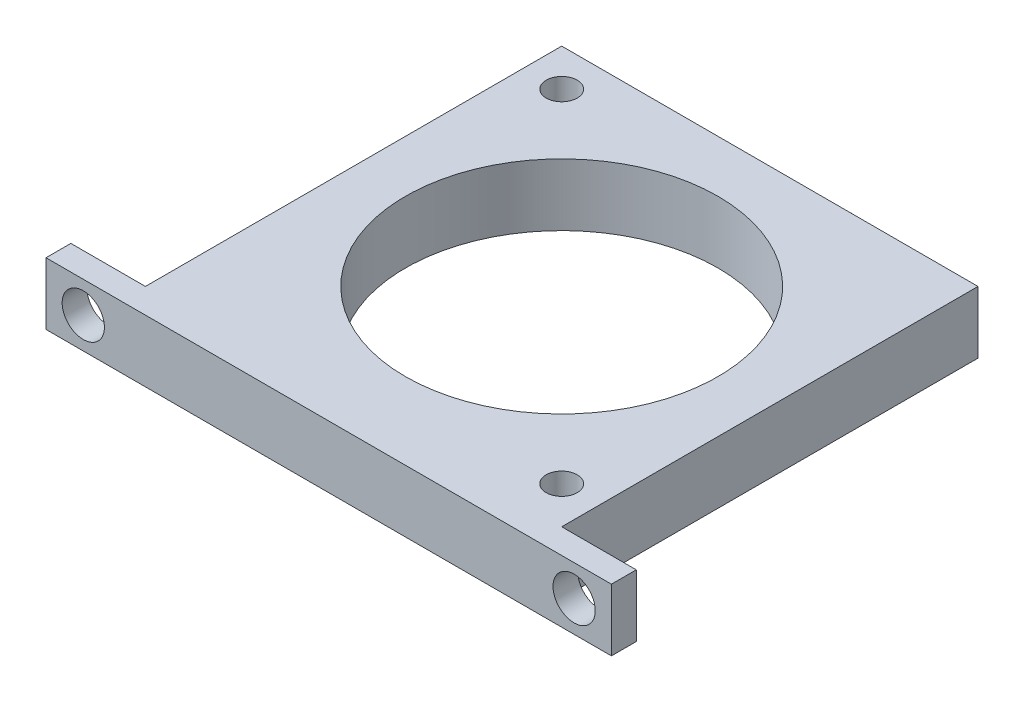
ISO-10303-21;
HEADER;
FILE_DESCRIPTION(('STEP AP214'),'2;1');
FILE_NAME('part.step','',(''),(''),'','','');
FILE_SCHEMA(('AUTOMOTIVE_DESIGN { 1 0 10303 214 1 1 1 1 }'));
ENDSEC;
DATA;
#1=APPLICATION_CONTEXT('core data for automotive mechanical design processes');
#2=APPLICATION_PROTOCOL_DEFINITION('international standard','automotive_design',2000,#1);
#3=PRODUCT_CONTEXT('',#1,'mechanical');
#4=PRODUCT('Part','Part','',(#3));
#5=PRODUCT_RELATED_PRODUCT_CATEGORY('part','',(#4));
#6=PRODUCT_DEFINITION_FORMATION('','',#4);
#7=PRODUCT_DEFINITION_CONTEXT('part definition',#1,'design');
#8=PRODUCT_DEFINITION('design','',#6,#7);
#9=PRODUCT_DEFINITION_SHAPE('','',#8);
#10=(LENGTH_UNIT() NAMED_UNIT(*) SI_UNIT(.MILLI.,.METRE.));
#11=(NAMED_UNIT(*) PLANE_ANGLE_UNIT() SI_UNIT($,.RADIAN.));
#12=(NAMED_UNIT(*) SI_UNIT($,.STERADIAN.) SOLID_ANGLE_UNIT());
#13=UNCERTAINTY_MEASURE_WITH_UNIT(LENGTH_MEASURE(1.E-05),#10,'distance_accuracy_value','');
#14=(GEOMETRIC_REPRESENTATION_CONTEXT(3) GLOBAL_UNCERTAINTY_ASSIGNED_CONTEXT((#13)) GLOBAL_UNIT_ASSIGNED_CONTEXT((#10,
#11,#12)) REPRESENTATION_CONTEXT('',''));
#15=CARTESIAN_POINT('',(0.,0.,0.));
#16=DIRECTION('',(0.,0.,1.));
#17=DIRECTION('',(1.,0.,0.));
#18=AXIS2_PLACEMENT_3D('',#15,#16,#17);
#19=CARTESIAN_POINT('',(16.75,70.,-16.75));
#20=DIRECTION('',(-1.,0.,0.));
#21=DIRECTION('',(0.,0.,1.));
#22=AXIS2_PLACEMENT_3D('',#19,#20,#21);
#23=PLANE('',#22);
#24=DIRECTION('',(0.,-1.,0.));
#25=VECTOR('',#24,1.);
#26=CARTESIAN_POINT('',(16.75,70.,16.75));
#27=LINE('',#26,#25);
#28=CARTESIAN_POINT('',(16.75,70.,16.75));
#29=VERTEX_POINT('',#28);
#30=CARTESIAN_POINT('',(16.75,65.,16.75));
#31=VERTEX_POINT('',#30);
#32=EDGE_CURVE('E158',#29,#31,#27,.T.);
#33=ORIENTED_EDGE('',*,*,#32,.T.);
#34=DIRECTION('',(0.,0.,-1.));
#35=VECTOR('',#34,1.);
#36=CARTESIAN_POINT('',(16.75,65.,-16.75));
#37=LINE('',#36,#35);
#38=CARTESIAN_POINT('',(16.75,65.,-16.75));
#39=VERTEX_POINT('',#38);
#40=EDGE_CURVE('E183',#31,#39,#37,.T.);
#41=ORIENTED_EDGE('',*,*,#40,.T.);
#42=DIRECTION('',(0.,-1.,0.));
#43=VECTOR('',#42,1.);
#44=CARTESIAN_POINT('',(16.75,70.,-16.75));
#45=LINE('',#44,#43);
#46=CARTESIAN_POINT('',(16.75,70.,-16.75));
#47=VERTEX_POINT('',#46);
#48=EDGE_CURVE('E11',#47,#39,#45,.T.);
#49=ORIENTED_EDGE('',*,*,#48,.F.);
#50=DIRECTION('',(0.,0.,-1.));
#51=VECTOR('',#50,1.);
#52=CARTESIAN_POINT('',(16.75,70.,-16.75));
#53=LINE('',#52,#51);
#54=EDGE_CURVE('E171',#29,#47,#53,.T.);
#55=ORIENTED_EDGE('',*,*,#54,.F.);
#56=EDGE_LOOP('',(#33,#41,#49,#55));
#57=FACE_BOUND('',#56,.T.);
#58=ADVANCED_FACE('F36',(#57),#23,.F.);
#59=CARTESIAN_POINT('',(-16.75,70.,-16.75));
#60=DIRECTION('',(0.,0.,1.));
#61=DIRECTION('',(1.,0.,0.));
#62=AXIS2_PLACEMENT_3D('',#59,#60,#61);
#63=PLANE('',#62);
#64=ORIENTED_EDGE('',*,*,#48,.T.);
#65=DIRECTION('',(-1.,0.,0.));
#66=VECTOR('',#65,1.);
#67=CARTESIAN_POINT('',(-22.75,65.,-16.75));
#68=LINE('',#67,#66);
#69=CARTESIAN_POINT('',(-16.75,65.,-16.75));
#70=VERTEX_POINT('',#69);
#71=EDGE_CURVE('E129',#39,#70,#68,.T.);
#72=ORIENTED_EDGE('',*,*,#71,.T.);
#73=DIRECTION('',(0.,-1.,0.));
#74=VECTOR('',#73,1.);
#75=CARTESIAN_POINT('',(-16.75,70.,-16.75));
#76=LINE('',#75,#74);
#77=CARTESIAN_POINT('',(-16.75,70.,-16.75));
#78=VERTEX_POINT('',#77);
#79=EDGE_CURVE('E44',#78,#70,#76,.T.);
#80=ORIENTED_EDGE('',*,*,#79,.F.);
#81=DIRECTION('',(-1.,0.,0.));
#82=VECTOR('',#81,1.);
#83=CARTESIAN_POINT('',(-16.75,70.,-16.75));
#84=LINE('',#83,#82);
#85=EDGE_CURVE('E60',#47,#78,#84,.T.);
#86=ORIENTED_EDGE('',*,*,#85,.F.);
#87=EDGE_LOOP('',(#64,#72,#80,#86));
#88=FACE_BOUND('',#87,.T.);
#89=ADVANCED_FACE('F207',(#88),#63,.F.);
#90=CARTESIAN_POINT('',(-16.75,70.,-16.75));
#91=DIRECTION('',(1.,0.,0.));
#92=DIRECTION('',(0.,0.,-1.));
#93=AXIS2_PLACEMENT_3D('',#90,#91,#92);
#94=PLANE('',#93);
#95=ORIENTED_EDGE('',*,*,#79,.T.);
#96=DIRECTION('',(0.,0.,1.));
#97=VECTOR('',#96,1.);
#98=CARTESIAN_POINT('',(-16.75,65.,-16.75));
#99=LINE('',#98,#97);
#100=CARTESIAN_POINT('',(-16.75,65.,16.75));
#101=VERTEX_POINT('',#100);
#102=EDGE_CURVE('E181',#70,#101,#99,.T.);
#103=ORIENTED_EDGE('',*,*,#102,.T.);
#104=DIRECTION('',(0.,-1.,0.));
#105=VECTOR('',#104,1.);
#106=CARTESIAN_POINT('',(-16.75,70.,16.75));
#107=LINE('',#106,#105);
#108=CARTESIAN_POINT('',(-16.75,70.,16.75));
#109=VERTEX_POINT('',#108);
#110=EDGE_CURVE('E161',#109,#101,#107,.T.);
#111=ORIENTED_EDGE('',*,*,#110,.F.);
#112=DIRECTION('',(0.,0.,1.));
#113=VECTOR('',#112,1.);
#114=CARTESIAN_POINT('',(-16.75,70.,-16.75));
#115=LINE('',#114,#113);
#116=EDGE_CURVE('E162',#78,#109,#115,.T.);
#117=ORIENTED_EDGE('',*,*,#116,.F.);
#118=EDGE_LOOP('',(#95,#103,#111,#117));
#119=FACE_BOUND('',#118,.T.);
#120=ADVANCED_FACE('F209',(#119),#94,.F.);
#121=CARTESIAN_POINT('',(0.,70.,0.));
#122=DIRECTION('',(0.,1.,0.));
#123=DIRECTION('',(0.,0.,1.));
#124=AXIS2_PLACEMENT_3D('',#121,#122,#123);
#125=PLANE('',#124);
#126=CARTESIAN_POINT('',(0.,70.,0.));
#127=DIRECTION('',(0.,-1.,0.));
#128=DIRECTION('',(0.,0.,-1.));
#129=AXIS2_PLACEMENT_3D('',#126,#127,#128);
#130=CIRCLE('',#129,12.573);
#131=CARTESIAN_POINT('',(0.,70.,-12.573));
#132=VERTEX_POINT('',#131);
#133=EDGE_CURVE('E188',#132,#132,#130,.T.);
#134=ORIENTED_EDGE('',*,*,#133,.T.);
#135=EDGE_LOOP('',(#134));
#136=FACE_BOUND('',#135,.T.);
#137=CARTESIAN_POINT('',(13.75,70.,13.75));
#138=DIRECTION('',(0.,1.,0.));
#139=DIRECTION('',(0.,0.,1.));
#140=AXIS2_PLACEMENT_3D('',#137,#138,#139);
#141=CIRCLE('',#140,1.24999999999999);
#142=CARTESIAN_POINT('',(13.75,70.,15.));
#143=VERTEX_POINT('',#142);
#144=EDGE_CURVE('E199',#143,#143,#141,.T.);
#145=ORIENTED_EDGE('',*,*,#144,.F.);
#146=EDGE_LOOP('',(#145));
#147=FACE_BOUND('',#146,.T.);
#148=CARTESIAN_POINT('',(-13.75,70.,-13.75));
#149=DIRECTION('',(0.,1.,0.));
#150=DIRECTION('',(0.,0.,1.));
#151=AXIS2_PLACEMENT_3D('',#148,#149,#150);
#152=CIRCLE('',#151,1.24999999999999);
#153=CARTESIAN_POINT('',(-13.75,70.,-12.5));
#154=VERTEX_POINT('',#153);
#155=EDGE_CURVE('E201',#154,#154,#152,.T.);
#156=ORIENTED_EDGE('',*,*,#155,.F.);
#157=EDGE_LOOP('',(#156));
#158=FACE_BOUND('',#157,.T.);
#159=ORIENTED_EDGE('',*,*,#54,.T.);
#160=ORIENTED_EDGE('',*,*,#85,.T.);
#161=ORIENTED_EDGE('',*,*,#116,.T.);
#162=DIRECTION('',(-1.,0.,0.));
#163=VECTOR('',#162,1.);
#164=CARTESIAN_POINT('',(-22.75,70.,16.75));
#165=LINE('',#164,#163);
#166=CARTESIAN_POINT('',(-22.75,70.,16.75));
#167=VERTEX_POINT('',#166);
#168=EDGE_CURVE('E141',#109,#167,#165,.T.);
#169=ORIENTED_EDGE('',*,*,#168,.T.);
#170=DIRECTION('',(0.,0.,-1.));
#171=VECTOR('',#170,1.);
#172=CARTESIAN_POINT('',(-22.75,70.,18.75));
#173=LINE('',#172,#171);
#174=CARTESIAN_POINT('',(-22.75,70.,18.75));
#175=VERTEX_POINT('',#174);
#176=EDGE_CURVE('E148',#175,#167,#173,.T.);
#177=ORIENTED_EDGE('',*,*,#176,.F.);
#178=DIRECTION('',(-1.,0.,0.));
#179=VECTOR('',#178,1.);
#180=CARTESIAN_POINT('',(-22.75,70.,18.75));
#181=LINE('',#180,#179);
#182=CARTESIAN_POINT('',(22.75,70.,18.75));
#183=VERTEX_POINT('',#182);
#184=EDGE_CURVE('E120',#183,#175,#181,.T.);
#185=ORIENTED_EDGE('',*,*,#184,.F.);
#186=DIRECTION('',(0.,0.,-1.));
#187=VECTOR('',#186,1.);
#188=CARTESIAN_POINT('',(22.75,70.,18.75));
#189=LINE('',#188,#187);
#190=CARTESIAN_POINT('',(22.75,70.,16.75));
#191=VERTEX_POINT('',#190);
#192=EDGE_CURVE('E134',#183,#191,#189,.T.);
#193=ORIENTED_EDGE('',*,*,#192,.T.);
#194=EDGE_CURVE('E124',#191,#29,#165,.T.);
#195=ORIENTED_EDGE('',*,*,#194,.T.);
#196=EDGE_LOOP('',(#159,#160,#161,#169,#177,#185,#193,#195));
#197=FACE_BOUND('',#196,.T.);
#198=ADVANCED_FACE('F153',(#136,#147,#158,#197),#125,.T.);
#199=CARTESIAN_POINT('',(-13.75,70.,-13.75));
#200=DIRECTION('',(0.,1.,0.));
#201=DIRECTION('',(0.,0.,1.));
#202=AXIS2_PLACEMENT_3D('',#199,#200,#201);
#203=CYLINDRICAL_SURFACE('',#202,1.24999999999999);
#204=CARTESIAN_POINT('',(-13.75,65.,-13.75));
#205=DIRECTION('',(0.,1.,0.));
#206=DIRECTION('',(0.,0.,1.));
#207=AXIS2_PLACEMENT_3D('',#204,#205,#206);
#208=CIRCLE('',#207,1.24999999999999);
#209=CARTESIAN_POINT('',(-13.75,65.,-12.5));
#210=VERTEX_POINT('',#209);
#211=EDGE_CURVE('E184',#210,#210,#208,.F.);
#212=ORIENTED_EDGE('',*,*,#211,.T.);
#213=EDGE_LOOP('',(#212));
#214=FACE_BOUND('',#213,.T.);
#215=ORIENTED_EDGE('',*,*,#155,.T.);
#216=EDGE_LOOP('',(#215));
#217=FACE_BOUND('',#216,.T.);
#218=ADVANCED_FACE('F262',(#214,#217),#203,.F.);
#219=CARTESIAN_POINT('',(13.75,70.,13.75));
#220=DIRECTION('',(0.,1.,0.));
#221=DIRECTION('',(0.,0.,1.));
#222=AXIS2_PLACEMENT_3D('',#219,#220,#221);
#223=CYLINDRICAL_SURFACE('',#222,1.24999999999999);
#224=CARTESIAN_POINT('',(13.75,65.,13.75));
#225=DIRECTION('',(0.,1.,0.));
#226=DIRECTION('',(0.,0.,1.));
#227=AXIS2_PLACEMENT_3D('',#224,#225,#226);
#228=CIRCLE('',#227,1.24999999999999);
#229=CARTESIAN_POINT('',(13.75,65.,15.));
#230=VERTEX_POINT('',#229);
#231=EDGE_CURVE('E190',#230,#230,#228,.F.);
#232=ORIENTED_EDGE('',*,*,#231,.T.);
#233=EDGE_LOOP('',(#232));
#234=FACE_BOUND('',#233,.T.);
#235=ORIENTED_EDGE('',*,*,#144,.T.);
#236=EDGE_LOOP('',(#235));
#237=FACE_BOUND('',#236,.T.);
#238=ADVANCED_FACE('F266',(#234,#237),#223,.F.);
#239=CARTESIAN_POINT('',(0.,70.,0.));
#240=DIRECTION('',(0.,-1.,0.));
#241=DIRECTION('',(0.,0.,-1.));
#242=AXIS2_PLACEMENT_3D('',#239,#240,#241);
#243=CYLINDRICAL_SURFACE('',#242,12.573);
#244=CARTESIAN_POINT('',(0.,65.,0.));
#245=DIRECTION('',(0.,1.,0.));
#246=DIRECTION('',(0.,0.,1.));
#247=AXIS2_PLACEMENT_3D('',#244,#245,#246);
#248=CIRCLE('',#247,12.573);
#249=CARTESIAN_POINT('',(0.,65.,12.573));
#250=VERTEX_POINT('',#249);
#251=EDGE_CURVE('E132',#250,#250,#248,.F.);
#252=ORIENTED_EDGE('',*,*,#251,.T.);
#253=EDGE_LOOP('',(#252));
#254=FACE_BOUND('',#253,.T.);
#255=ORIENTED_EDGE('',*,*,#133,.F.);
#256=EDGE_LOOP('',(#255));
#257=FACE_BOUND('',#256,.T.);
#258=ADVANCED_FACE('F243',(#254,#257),#243,.F.);
#259=CARTESIAN_POINT('',(-22.75,65.,-16.75));
#260=DIRECTION('',(0.,1.,0.));
#261=DIRECTION('',(0.,0.,1.));
#262=AXIS2_PLACEMENT_3D('',#259,#260,#261);
#263=PLANE('',#262);
#264=ORIENTED_EDGE('',*,*,#231,.F.);
#265=EDGE_LOOP('',(#264));
#266=FACE_BOUND('',#265,.T.);
#267=ORIENTED_EDGE('',*,*,#251,.F.);
#268=EDGE_LOOP('',(#267));
#269=FACE_BOUND('',#268,.T.);
#270=ORIENTED_EDGE('',*,*,#211,.F.);
#271=EDGE_LOOP('',(#270));
#272=FACE_BOUND('',#271,.T.);
#273=ORIENTED_EDGE('',*,*,#40,.F.);
#274=DIRECTION('',(1.,0.,0.));
#275=VECTOR('',#274,1.);
#276=CARTESIAN_POINT('',(-22.75,65.,16.75));
#277=LINE('',#276,#275);
#278=CARTESIAN_POINT('',(22.75,65.,16.75));
#279=VERTEX_POINT('',#278);
#280=EDGE_CURVE('E52',#31,#279,#277,.T.);
#281=ORIENTED_EDGE('',*,*,#280,.T.);
#282=DIRECTION('',(0.,0.,-1.));
#283=VECTOR('',#282,1.);
#284=CARTESIAN_POINT('',(22.75,65.,18.75));
#285=LINE('',#284,#283);
#286=CARTESIAN_POINT('',(22.75,65.,18.75));
#287=VERTEX_POINT('',#286);
#288=EDGE_CURVE('E111',#287,#279,#285,.T.);
#289=ORIENTED_EDGE('',*,*,#288,.F.);
#290=DIRECTION('',(1.,0.,0.));
#291=VECTOR('',#290,1.);
#292=CARTESIAN_POINT('',(-22.75,65.,18.75));
#293=LINE('',#292,#291);
#294=CARTESIAN_POINT('',(-22.75,65.,18.75));
#295=VERTEX_POINT('',#294);
#296=EDGE_CURVE('E103',#295,#287,#293,.T.);
#297=ORIENTED_EDGE('',*,*,#296,.F.);
#298=DIRECTION('',(0.,0.,-1.));
#299=VECTOR('',#298,1.);
#300=CARTESIAN_POINT('',(-22.75,65.,18.75));
#301=LINE('',#300,#299);
#302=CARTESIAN_POINT('',(-22.75,65.,16.75));
#303=VERTEX_POINT('',#302);
#304=EDGE_CURVE('E108',#295,#303,#301,.T.);
#305=ORIENTED_EDGE('',*,*,#304,.T.);
#306=EDGE_CURVE('E212',#303,#101,#277,.T.);
#307=ORIENTED_EDGE('',*,*,#306,.T.);
#308=ORIENTED_EDGE('',*,*,#102,.F.);
#309=ORIENTED_EDGE('',*,*,#71,.F.);
#310=EDGE_LOOP('',(#273,#281,#289,#297,#305,#307,#308,#309));
#311=FACE_BOUND('',#310,.T.);
#312=ADVANCED_FACE('F105',(#266,#269,#272,#311),#263,.F.);
#313=CARTESIAN_POINT('',(0.,0.,16.75));
#314=DIRECTION('',(0.,0.,1.));
#315=DIRECTION('',(1.,0.,0.));
#316=AXIS2_PLACEMENT_3D('',#313,#314,#315);
#317=PLANE('',#316);
#318=CARTESIAN_POINT('',(-19.75,67.5,16.75));
#319=DIRECTION('',(0.,0.,-1.));
#320=DIRECTION('',(-1.,0.,0.));
#321=AXIS2_PLACEMENT_3D('',#318,#319,#320);
#322=CIRCLE('',#321,1.69999999999999);
#323=CARTESIAN_POINT('',(-21.45,67.5,16.75));
#324=VERTEX_POINT('',#323);
#325=EDGE_CURVE('E230',#324,#324,#322,.T.);
#326=ORIENTED_EDGE('',*,*,#325,.F.);
#327=EDGE_LOOP('',(#326));
#328=FACE_BOUND('',#327,.T.);
#329=ORIENTED_EDGE('',*,*,#168,.F.);
#330=ORIENTED_EDGE('',*,*,#110,.T.);
#331=ORIENTED_EDGE('',*,*,#306,.F.);
#332=DIRECTION('',(0.,-1.,0.));
#333=VECTOR('',#332,1.);
#334=CARTESIAN_POINT('',(-22.75,70.,16.75));
#335=LINE('',#334,#333);
#336=EDGE_CURVE('E128',#167,#303,#335,.T.);
#337=ORIENTED_EDGE('',*,*,#336,.F.);
#338=EDGE_LOOP('',(#329,#330,#331,#337));
#339=FACE_BOUND('',#338,.T.);
#340=ADVANCED_FACE('F211',(#328,#339),#317,.F.);
#341=CARTESIAN_POINT('',(-22.75,70.,18.75));
#342=DIRECTION('',(1.,0.,0.));
#343=DIRECTION('',(0.,0.,-1.));
#344=AXIS2_PLACEMENT_3D('',#341,#342,#343);
#345=PLANE('',#344);
#346=ORIENTED_EDGE('',*,*,#336,.T.);
#347=ORIENTED_EDGE('',*,*,#304,.F.);
#348=DIRECTION('',(0.,-1.,0.));
#349=VECTOR('',#348,1.);
#350=CARTESIAN_POINT('',(-22.75,70.,18.75));
#351=LINE('',#350,#349);
#352=EDGE_CURVE('E115',#175,#295,#351,.T.);
#353=ORIENTED_EDGE('',*,*,#352,.F.);
#354=ORIENTED_EDGE('',*,*,#176,.T.);
#355=EDGE_LOOP('',(#346,#347,#353,#354));
#356=FACE_BOUND('',#355,.T.);
#357=ADVANCED_FACE('F126',(#356),#345,.F.);
#358=CARTESIAN_POINT('',(22.75,70.,18.75));
#359=DIRECTION('',(-1.,0.,0.));
#360=DIRECTION('',(0.,-1.,0.));
#361=AXIS2_PLACEMENT_3D('',#358,#359,#360);
#362=PLANE('',#361);
#363=DIRECTION('',(0.,1.,0.));
#364=VECTOR('',#363,1.);
#365=CARTESIAN_POINT('',(22.75,70.,16.75));
#366=LINE('',#365,#364);
#367=EDGE_CURVE('E146',#279,#191,#366,.T.);
#368=ORIENTED_EDGE('',*,*,#367,.T.);
#369=ORIENTED_EDGE('',*,*,#192,.F.);
#370=DIRECTION('',(0.,1.,0.));
#371=VECTOR('',#370,1.);
#372=CARTESIAN_POINT('',(22.75,70.,18.75));
#373=LINE('',#372,#371);
#374=EDGE_CURVE('E114',#287,#183,#373,.T.);
#375=ORIENTED_EDGE('',*,*,#374,.F.);
#376=ORIENTED_EDGE('',*,*,#288,.T.);
#377=EDGE_LOOP('',(#368,#369,#375,#376));
#378=FACE_BOUND('',#377,.T.);
#379=ADVANCED_FACE('F223',(#378),#362,.F.);
#380=CARTESIAN_POINT('',(0.,0.,18.75));
#381=DIRECTION('',(0.,0.,1.));
#382=DIRECTION('',(1.,0.,0.));
#383=AXIS2_PLACEMENT_3D('',#380,#381,#382);
#384=PLANE('',#383);
#385=CARTESIAN_POINT('',(-19.75,67.5,18.75));
#386=DIRECTION('',(0.,0.,-1.));
#387=DIRECTION('',(-1.,0.,0.));
#388=AXIS2_PLACEMENT_3D('',#385,#386,#387);
#389=CIRCLE('',#388,1.7);
#390=CARTESIAN_POINT('',(-21.45,67.5,18.75));
#391=VERTEX_POINT('',#390);
#392=EDGE_CURVE('E227',#391,#391,#389,.T.);
#393=ORIENTED_EDGE('',*,*,#392,.T.);
#394=EDGE_LOOP('',(#393));
#395=FACE_BOUND('',#394,.T.);
#396=CARTESIAN_POINT('',(19.75,67.5,18.75));
#397=DIRECTION('',(0.,0.,-1.));
#398=DIRECTION('',(-1.,0.,0.));
#399=AXIS2_PLACEMENT_3D('',#396,#397,#398);
#400=CIRCLE('',#399,1.7);
#401=CARTESIAN_POINT('',(18.05,67.5,18.75));
#402=VERTEX_POINT('',#401);
#403=EDGE_CURVE('E213',#402,#402,#400,.T.);
#404=ORIENTED_EDGE('',*,*,#403,.T.);
#405=EDGE_LOOP('',(#404));
#406=FACE_BOUND('',#405,.T.);
#407=ORIENTED_EDGE('',*,*,#352,.T.);
#408=ORIENTED_EDGE('',*,*,#296,.T.);
#409=ORIENTED_EDGE('',*,*,#374,.T.);
#410=ORIENTED_EDGE('',*,*,#184,.T.);
#411=EDGE_LOOP('',(#407,#408,#409,#410));
#412=FACE_BOUND('',#411,.T.);
#413=ADVANCED_FACE('F118',(#395,#406,#412),#384,.T.);
#414=CARTESIAN_POINT('',(19.75,67.5,16.75));
#415=DIRECTION('',(0.,0.,-1.));
#416=DIRECTION('',(-1.,0.,0.));
#417=AXIS2_PLACEMENT_3D('',#414,#415,#416);
#418=CIRCLE('',#417,1.69999999999999);
#419=CARTESIAN_POINT('',(18.05,67.5,16.75));
#420=VERTEX_POINT('',#419);
#421=EDGE_CURVE('E217',#420,#420,#418,.T.);
#422=ORIENTED_EDGE('',*,*,#421,.F.);
#423=EDGE_LOOP('',(#422));
#424=FACE_BOUND('',#423,.T.);
#425=ORIENTED_EDGE('',*,*,#32,.F.);
#426=ORIENTED_EDGE('',*,*,#194,.F.);
#427=ORIENTED_EDGE('',*,*,#367,.F.);
#428=ORIENTED_EDGE('',*,*,#280,.F.);
#429=EDGE_LOOP('',(#425,#426,#427,#428));
#430=FACE_BOUND('',#429,.T.);
#431=ADVANCED_FACE('F156',(#424,#430),#317,.F.);
#432=CARTESIAN_POINT('',(19.75,67.5,16.75));
#433=DIRECTION('',(0.,0.,-1.));
#434=DIRECTION('',(-1.,0.,0.));
#435=AXIS2_PLACEMENT_3D('',#432,#433,#434);
#436=CYLINDRICAL_SURFACE('',#435,1.69999999999999);
#437=ORIENTED_EDGE('',*,*,#403,.F.);
#438=EDGE_LOOP('',(#437));
#439=FACE_BOUND('',#438,.T.);
#440=ORIENTED_EDGE('',*,*,#421,.T.);
#441=EDGE_LOOP('',(#440));
#442=FACE_BOUND('',#441,.T.);
#443=ADVANCED_FACE('F249',(#439,#442),#436,.F.);
#444=CARTESIAN_POINT('',(-19.75,67.5,16.75));
#445=DIRECTION('',(0.,0.,-1.));
#446=DIRECTION('',(-1.,0.,0.));
#447=AXIS2_PLACEMENT_3D('',#444,#445,#446);
#448=CYLINDRICAL_SURFACE('',#447,1.69999999999999);
#449=ORIENTED_EDGE('',*,*,#392,.F.);
#450=EDGE_LOOP('',(#449));
#451=FACE_BOUND('',#450,.T.);
#452=ORIENTED_EDGE('',*,*,#325,.T.);
#453=EDGE_LOOP('',(#452));
#454=FACE_BOUND('',#453,.T.);
#455=ADVANCED_FACE('F234',(#451,#454),#448,.F.);
#456=CLOSED_SHELL('',(#58,#89,#120,#198,#218,#238,#258,#312,#340,#357,#379,#413,#431,#443,#455));
#457=MANIFOLD_SOLID_BREP('B2',#456);
#458=ADVANCED_BREP_SHAPE_REPRESENTATION('',(#18,#457),#14);
#459=SHAPE_DEFINITION_REPRESENTATION(#9,#458);
ENDSEC;
END-ISO-10303-21;
